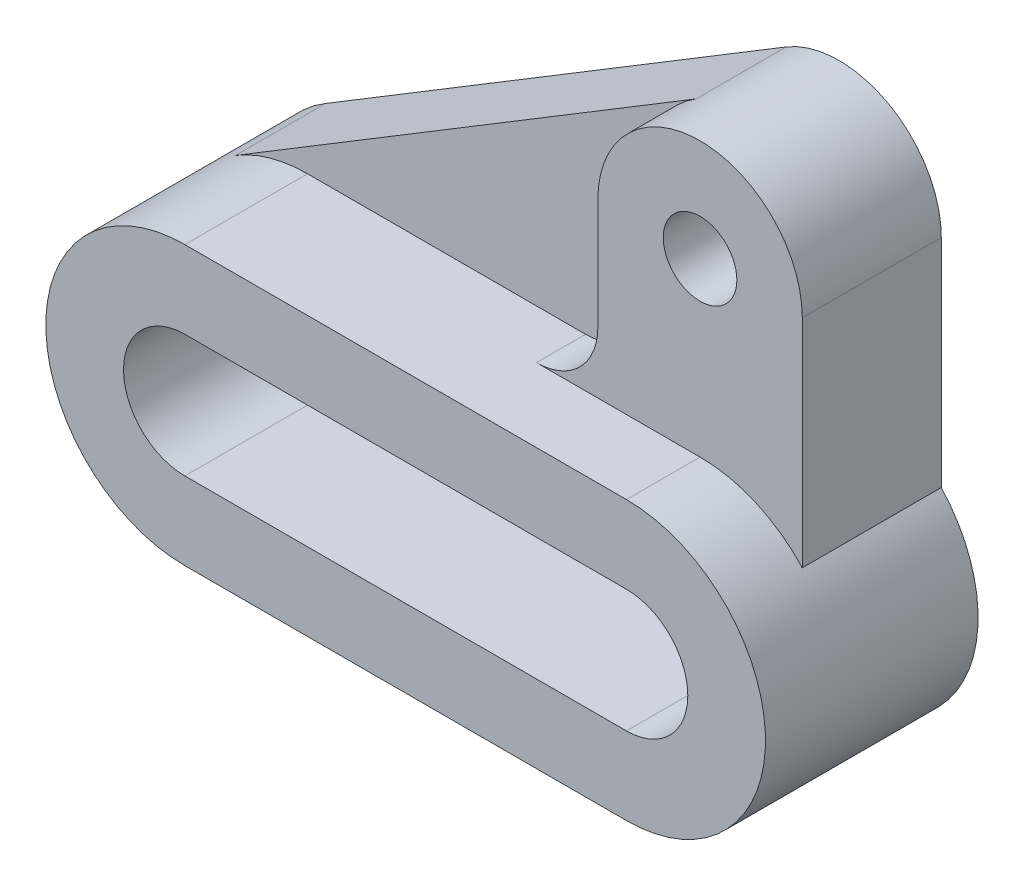
ISO-10303-21;
HEADER;
FILE_DESCRIPTION(('STEP AP214'),'2;1');
FILE_NAME('part.step','',(''),(''),'','','');
FILE_SCHEMA(('AUTOMOTIVE_DESIGN { 1 0 10303 214 1 1 1 1 }'));
ENDSEC;
DATA;
#1=APPLICATION_CONTEXT('core data for automotive mechanical design processes');
#2=APPLICATION_PROTOCOL_DEFINITION('international standard','automotive_design',2000,#1);
#3=PRODUCT_CONTEXT('',#1,'mechanical');
#4=PRODUCT('Part','Part','',(#3));
#5=PRODUCT_RELATED_PRODUCT_CATEGORY('part','',(#4));
#6=PRODUCT_DEFINITION_FORMATION('','',#4);
#7=PRODUCT_DEFINITION_CONTEXT('part definition',#1,'design');
#8=PRODUCT_DEFINITION('design','',#6,#7);
#9=PRODUCT_DEFINITION_SHAPE('','',#8);
#10=(LENGTH_UNIT() NAMED_UNIT(*) SI_UNIT(.MILLI.,.METRE.));
#11=(NAMED_UNIT(*) PLANE_ANGLE_UNIT() SI_UNIT($,.RADIAN.));
#12=(NAMED_UNIT(*) SI_UNIT($,.STERADIAN.) SOLID_ANGLE_UNIT());
#13=UNCERTAINTY_MEASURE_WITH_UNIT(LENGTH_MEASURE(1.E-05),#10,'distance_accuracy_value','');
#14=(GEOMETRIC_REPRESENTATION_CONTEXT(3) GLOBAL_UNCERTAINTY_ASSIGNED_CONTEXT((#13)) GLOBAL_UNIT_ASSIGNED_CONTEXT((#10,
#11,#12)) REPRESENTATION_CONTEXT('',''));
#15=CARTESIAN_POINT('',(0.,0.,0.));
#16=DIRECTION('',(0.,0.,1.));
#17=DIRECTION('',(1.,0.,0.));
#18=AXIS2_PLACEMENT_3D('',#15,#16,#17);
#19=CARTESIAN_POINT('',(0.,34.,52.));
#20=DIRECTION('',(0.,1.,0.));
#21=DIRECTION('',(-1.,0.,0.));
#22=AXIS2_PLACEMENT_3D('',#19,#20,#21);
#23=PLANE('',#22);
#24=DIRECTION('',(1.,0.,0.));
#25=VECTOR('',#24,1.);
#26=CARTESIAN_POINT('',(0.,34.,34.));
#27=LINE('',#26,#25);
#28=CARTESIAN_POINT('',(68.,34.,34.));
#29=VERTEX_POINT('',#28);
#30=CARTESIAN_POINT('',(108.,34.,34.));
#31=VERTEX_POINT('',#30);
#32=EDGE_CURVE('E181',#29,#31,#27,.T.);
#33=ORIENTED_EDGE('',*,*,#32,.F.);
#34=DIRECTION('',(0.,0.,-1.));
#35=VECTOR('',#34,1.);
#36=CARTESIAN_POINT('',(68.,34.,52.));
#37=LINE('',#36,#35);
#38=CARTESIAN_POINT('',(68.,34.,22.));
#39=VERTEX_POINT('',#38);
#40=EDGE_CURVE('E266',#29,#39,#37,.T.);
#41=ORIENTED_EDGE('',*,*,#40,.T.);
#42=DIRECTION('',(1.,0.,0.));
#43=VECTOR('',#42,1.);
#44=CARTESIAN_POINT('',(0.,34.,22.));
#45=LINE('',#44,#43);
#46=CARTESIAN_POINT('',(0.,34.,22.));
#47=VERTEX_POINT('',#46);
#48=EDGE_CURVE('E200',#47,#39,#45,.T.);
#49=ORIENTED_EDGE('',*,*,#48,.F.);
#50=DIRECTION('',(0.,0.,-1.));
#51=VECTOR('',#50,1.);
#52=CARTESIAN_POINT('',(0.,34.,52.));
#53=LINE('',#52,#51);
#54=CARTESIAN_POINT('',(0.,34.,52.));
#55=VERTEX_POINT('',#54);
#56=EDGE_CURVE('E263',#55,#47,#53,.T.);
#57=ORIENTED_EDGE('',*,*,#56,.F.);
#58=DIRECTION('',(1.,0.,0.));
#59=VECTOR('',#58,1.);
#60=CARTESIAN_POINT('',(0.,34.,52.));
#61=LINE('',#60,#59);
#62=CARTESIAN_POINT('',(108.,34.,52.));
#63=VERTEX_POINT('',#62);
#64=EDGE_CURVE('E224',#55,#63,#61,.T.);
#65=ORIENTED_EDGE('',*,*,#64,.T.);
#66=DIRECTION('',(0.,0.,-1.));
#67=VECTOR('',#66,1.);
#68=CARTESIAN_POINT('',(108.,34.,52.));
#69=LINE('',#68,#67);
#70=EDGE_CURVE('E253',#63,#31,#69,.T.);
#71=ORIENTED_EDGE('',*,*,#70,.T.);
#72=EDGE_LOOP('',(#33,#41,#49,#57,#65,#71));
#73=FACE_BOUND('',#72,.T.);
#74=ADVANCED_FACE('F41',(#73),#23,.T.);
#75=CARTESIAN_POINT('',(0.,0.,52.));
#76=DIRECTION('',(0.,0.,-1.));
#77=DIRECTION('',(-1.,0.,0.));
#78=AXIS2_PLACEMENT_3D('',#75,#76,#77);
#79=CYLINDRICAL_SURFACE('',#78,34.);
#80=CARTESIAN_POINT('',(0.,0.,22.));
#81=DIRECTION('',(0.,0.,1.));
#82=DIRECTION('',(1.,0.,0.));
#83=AXIS2_PLACEMENT_3D('',#80,#81,#82);
#84=CIRCLE('',#83,34.);
#85=CARTESIAN_POINT('',(-17.6263298981798,29.0742582763608,22.));
#86=VERTEX_POINT('',#85);
#87=EDGE_CURVE('E197',#47,#86,#84,.T.);
#88=ORIENTED_EDGE('',*,*,#87,.T.);
#89=DIRECTION('',(0.,0.,-1.));
#90=VECTOR('',#89,1.);
#91=CARTESIAN_POINT('',(-17.6263298981798,29.0742582763608,22.));
#92=LINE('',#91,#90);
#93=CARTESIAN_POINT('',(-17.6263298981798,29.0742582763608,0.));
#94=VERTEX_POINT('',#93);
#95=EDGE_CURVE('E204',#86,#94,#92,.T.);
#96=ORIENTED_EDGE('',*,*,#95,.T.);
#97=CARTESIAN_POINT('',(0.,0.,0.));
#98=DIRECTION('',(0.,0.,1.));
#99=DIRECTION('',(1.,0.,0.));
#100=AXIS2_PLACEMENT_3D('',#97,#98,#99);
#101=CIRCLE('',#100,34.);
#102=CARTESIAN_POINT('',(0.,-34.,0.));
#103=VERTEX_POINT('',#102);
#104=EDGE_CURVE('E247',#94,#103,#101,.T.);
#105=ORIENTED_EDGE('',*,*,#104,.T.);
#106=DIRECTION('',(0.,0.,-1.));
#107=VECTOR('',#106,1.);
#108=CARTESIAN_POINT('',(0.,-34.,52.));
#109=LINE('',#108,#107);
#110=CARTESIAN_POINT('',(0.,-34.,52.));
#111=VERTEX_POINT('',#110);
#112=EDGE_CURVE('E260',#111,#103,#109,.T.);
#113=ORIENTED_EDGE('',*,*,#112,.F.);
#114=CARTESIAN_POINT('',(0.,0.,52.));
#115=DIRECTION('',(0.,0.,1.));
#116=DIRECTION('',(1.,0.,0.));
#117=AXIS2_PLACEMENT_3D('',#114,#115,#116);
#118=CIRCLE('',#117,34.);
#119=EDGE_CURVE('E227',#55,#111,#118,.T.);
#120=ORIENTED_EDGE('',*,*,#119,.F.);
#121=ORIENTED_EDGE('',*,*,#56,.T.);
#122=EDGE_LOOP('',(#88,#96,#105,#113,#120,#121));
#123=FACE_BOUND('',#122,.T.);
#124=ADVANCED_FACE('F283',(#123),#79,.T.);
#125=CARTESIAN_POINT('',(0.,-34.,52.));
#126=DIRECTION('',(0.,1.,0.));
#127=DIRECTION('',(-1.,0.,0.));
#128=AXIS2_PLACEMENT_3D('',#125,#126,#127);
#129=PLANE('',#128);
#130=DIRECTION('',(1.,0.,0.));
#131=VECTOR('',#130,1.);
#132=CARTESIAN_POINT('',(0.,-34.,0.));
#133=LINE('',#132,#131);
#134=CARTESIAN_POINT('',(108.,-34.,0.));
#135=VERTEX_POINT('',#134);
#136=EDGE_CURVE('E249',#103,#135,#133,.T.);
#137=ORIENTED_EDGE('',*,*,#136,.T.);
#138=DIRECTION('',(0.,0.,-1.));
#139=VECTOR('',#138,1.);
#140=CARTESIAN_POINT('',(108.,-34.,52.));
#141=LINE('',#140,#139);
#142=CARTESIAN_POINT('',(108.,-34.,52.));
#143=VERTEX_POINT('',#142);
#144=EDGE_CURVE('E256',#143,#135,#141,.T.);
#145=ORIENTED_EDGE('',*,*,#144,.F.);
#146=DIRECTION('',(1.,0.,0.));
#147=VECTOR('',#146,1.);
#148=CARTESIAN_POINT('',(0.,-34.,52.));
#149=LINE('',#148,#147);
#150=EDGE_CURVE('E230',#111,#143,#149,.T.);
#151=ORIENTED_EDGE('',*,*,#150,.F.);
#152=ORIENTED_EDGE('',*,*,#112,.T.);
#153=EDGE_LOOP('',(#137,#145,#151,#152));
#154=FACE_BOUND('',#153,.T.);
#155=ADVANCED_FACE('F317',(#154),#129,.F.);
#156=CARTESIAN_POINT('',(108.,0.,52.));
#157=DIRECTION('',(0.,0.,-1.));
#158=DIRECTION('',(-1.,0.,0.));
#159=AXIS2_PLACEMENT_3D('',#156,#157,#158);
#160=CYLINDRICAL_SURFACE('',#159,15.);
#161=CARTESIAN_POINT('',(108.,0.,0.));
#162=DIRECTION('',(0.,0.,1.));
#163=DIRECTION('',(1.,0.,0.));
#164=AXIS2_PLACEMENT_3D('',#161,#162,#163);
#165=CIRCLE('',#164,15.);
#166=CARTESIAN_POINT('',(108.,-15.,0.));
#167=VERTEX_POINT('',#166);
#168=CARTESIAN_POINT('',(108.,15.,0.));
#169=VERTEX_POINT('',#168);
#170=EDGE_CURVE('E211',#167,#169,#165,.T.);
#171=ORIENTED_EDGE('',*,*,#170,.F.);
#172=DIRECTION('',(0.,0.,-1.));
#173=VECTOR('',#172,1.);
#174=CARTESIAN_POINT('',(108.,-15.,52.));
#175=LINE('',#174,#173);
#176=CARTESIAN_POINT('',(108.,-15.,52.));
#177=VERTEX_POINT('',#176);
#178=EDGE_CURVE('E257',#177,#167,#175,.T.);
#179=ORIENTED_EDGE('',*,*,#178,.F.);
#180=CARTESIAN_POINT('',(108.,0.,52.));
#181=DIRECTION('',(0.,0.,1.));
#182=DIRECTION('',(1.,0.,0.));
#183=AXIS2_PLACEMENT_3D('',#180,#181,#182);
#184=CIRCLE('',#183,15.);
#185=CARTESIAN_POINT('',(108.,15.,52.));
#186=VERTEX_POINT('',#185);
#187=EDGE_CURVE('E212',#177,#186,#184,.T.);
#188=ORIENTED_EDGE('',*,*,#187,.T.);
#189=DIRECTION('',(0.,0.,-1.));
#190=VECTOR('',#189,1.);
#191=CARTESIAN_POINT('',(108.,15.,52.));
#192=LINE('',#191,#190);
#193=EDGE_CURVE('E235',#186,#169,#192,.T.);
#194=ORIENTED_EDGE('',*,*,#193,.T.);
#195=EDGE_LOOP('',(#171,#179,#188,#194));
#196=FACE_BOUND('',#195,.T.);
#197=ADVANCED_FACE('F331',(#196),#160,.F.);
#198=CARTESIAN_POINT('',(0.,-15.,52.));
#199=DIRECTION('',(0.,1.,0.));
#200=DIRECTION('',(-1.,0.,0.));
#201=AXIS2_PLACEMENT_3D('',#198,#199,#200);
#202=PLANE('',#201);
#203=DIRECTION('',(1.,0.,0.));
#204=VECTOR('',#203,1.);
#205=CARTESIAN_POINT('',(0.,-15.,0.));
#206=LINE('',#205,#204);
#207=CARTESIAN_POINT('',(0.,-15.,0.));
#208=VERTEX_POINT('',#207);
#209=EDGE_CURVE('E238',#208,#167,#206,.T.);
#210=ORIENTED_EDGE('',*,*,#209,.F.);
#211=DIRECTION('',(0.,0.,-1.));
#212=VECTOR('',#211,1.);
#213=CARTESIAN_POINT('',(0.,-15.,52.));
#214=LINE('',#213,#212);
#215=CARTESIAN_POINT('',(0.,-15.,52.));
#216=VERTEX_POINT('',#215);
#217=EDGE_CURVE('E270',#216,#208,#214,.T.);
#218=ORIENTED_EDGE('',*,*,#217,.F.);
#219=DIRECTION('',(1.,0.,0.));
#220=VECTOR('',#219,1.);
#221=CARTESIAN_POINT('',(0.,-15.,52.));
#222=LINE('',#221,#220);
#223=EDGE_CURVE('E215',#216,#177,#222,.T.);
#224=ORIENTED_EDGE('',*,*,#223,.T.);
#225=ORIENTED_EDGE('',*,*,#178,.T.);
#226=EDGE_LOOP('',(#210,#218,#224,#225));
#227=FACE_BOUND('',#226,.T.);
#228=ADVANCED_FACE('F328',(#227),#202,.T.);
#229=CARTESIAN_POINT('',(0.,0.,52.));
#230=DIRECTION('',(0.,0.,-1.));
#231=DIRECTION('',(-1.,0.,0.));
#232=AXIS2_PLACEMENT_3D('',#229,#230,#231);
#233=CYLINDRICAL_SURFACE('',#232,15.);
#234=CARTESIAN_POINT('',(0.,0.,0.));
#235=DIRECTION('',(0.,0.,1.));
#236=DIRECTION('',(1.,0.,0.));
#237=AXIS2_PLACEMENT_3D('',#234,#235,#236);
#238=CIRCLE('',#237,15.);
#239=CARTESIAN_POINT('',(0.,15.,0.));
#240=VERTEX_POINT('',#239);
#241=EDGE_CURVE('E241',#240,#208,#238,.T.);
#242=ORIENTED_EDGE('',*,*,#241,.F.);
#243=DIRECTION('',(0.,0.,-1.));
#244=VECTOR('',#243,1.);
#245=CARTESIAN_POINT('',(0.,15.,52.));
#246=LINE('',#245,#244);
#247=CARTESIAN_POINT('',(0.,15.,52.));
#248=VERTEX_POINT('',#247);
#249=EDGE_CURVE('E268',#248,#240,#246,.T.);
#250=ORIENTED_EDGE('',*,*,#249,.F.);
#251=CARTESIAN_POINT('',(0.,0.,52.));
#252=DIRECTION('',(0.,0.,1.));
#253=DIRECTION('',(1.,0.,0.));
#254=AXIS2_PLACEMENT_3D('',#251,#252,#253);
#255=CIRCLE('',#254,15.);
#256=EDGE_CURVE('E219',#248,#216,#255,.T.);
#257=ORIENTED_EDGE('',*,*,#256,.T.);
#258=ORIENTED_EDGE('',*,*,#217,.T.);
#259=EDGE_LOOP('',(#242,#250,#257,#258));
#260=FACE_BOUND('',#259,.T.);
#261=ADVANCED_FACE('F324',(#260),#233,.F.);
#262=CARTESIAN_POINT('',(0.,15.,52.));
#263=DIRECTION('',(0.,1.,0.));
#264=DIRECTION('',(-1.,0.,0.));
#265=AXIS2_PLACEMENT_3D('',#262,#263,#264);
#266=PLANE('',#265);
#267=DIRECTION('',(1.,0.,0.));
#268=VECTOR('',#267,1.);
#269=CARTESIAN_POINT('',(0.,15.,0.));
#270=LINE('',#269,#268);
#271=EDGE_CURVE('E244',#240,#169,#270,.T.);
#272=ORIENTED_EDGE('',*,*,#271,.T.);
#273=ORIENTED_EDGE('',*,*,#193,.F.);
#274=DIRECTION('',(1.,0.,0.));
#275=VECTOR('',#274,1.);
#276=CARTESIAN_POINT('',(0.,15.,52.));
#277=LINE('',#276,#275);
#278=EDGE_CURVE('E222',#248,#186,#277,.T.);
#279=ORIENTED_EDGE('',*,*,#278,.F.);
#280=ORIENTED_EDGE('',*,*,#249,.T.);
#281=EDGE_LOOP('',(#272,#273,#279,#280));
#282=FACE_BOUND('',#281,.T.);
#283=ADVANCED_FACE('F321',(#282),#266,.F.);
#284=CARTESIAN_POINT('',(108.,0.,52.));
#285=DIRECTION('',(0.,0.,-1.));
#286=DIRECTION('',(-1.,0.,0.));
#287=AXIS2_PLACEMENT_3D('',#284,#285,#286);
#288=CYLINDRICAL_SURFACE('',#287,34.);
#289=CARTESIAN_POINT('',(108.,0.,0.));
#290=DIRECTION('',(0.,0.,1.));
#291=DIRECTION('',(1.,0.,0.));
#292=AXIS2_PLACEMENT_3D('',#289,#290,#291);
#293=CIRCLE('',#292,34.);
#294=CARTESIAN_POINT('',(133.,23.0434372436058,0.));
#295=VERTEX_POINT('',#294);
#296=EDGE_CURVE('E216',#135,#295,#293,.T.);
#297=ORIENTED_EDGE('',*,*,#296,.T.);
#298=DIRECTION('',(0.,0.,-1.));
#299=VECTOR('',#298,1.);
#300=CARTESIAN_POINT('',(133.,23.0434372436058,34.));
#301=LINE('',#300,#299);
#302=CARTESIAN_POINT('',(133.,23.0434372436058,34.));
#303=VERTEX_POINT('',#302);
#304=EDGE_CURVE('E184',#303,#295,#301,.T.);
#305=ORIENTED_EDGE('',*,*,#304,.F.);
#306=CARTESIAN_POINT('',(108.,0.,34.));
#307=DIRECTION('',(0.,0.,1.));
#308=DIRECTION('',(1.,0.,0.));
#309=AXIS2_PLACEMENT_3D('',#306,#307,#308);
#310=CIRCLE('',#309,34.);
#311=EDGE_CURVE('E173',#303,#31,#310,.T.);
#312=ORIENTED_EDGE('',*,*,#311,.T.);
#313=ORIENTED_EDGE('',*,*,#70,.F.);
#314=CARTESIAN_POINT('',(108.,0.,52.));
#315=DIRECTION('',(0.,0.,1.));
#316=DIRECTION('',(1.,0.,0.));
#317=AXIS2_PLACEMENT_3D('',#314,#315,#316);
#318=CIRCLE('',#317,34.);
#319=EDGE_CURVE('E233',#143,#63,#318,.T.);
#320=ORIENTED_EDGE('',*,*,#319,.F.);
#321=ORIENTED_EDGE('',*,*,#144,.T.);
#322=EDGE_LOOP('',(#297,#305,#312,#313,#320,#321));
#323=FACE_BOUND('',#322,.T.);
#324=ADVANCED_FACE('F293',(#323),#288,.T.);
#325=CARTESIAN_POINT('',(0.,0.,52.));
#326=DIRECTION('',(0.,0.,1.));
#327=DIRECTION('',(1.,0.,0.));
#328=AXIS2_PLACEMENT_3D('',#325,#326,#327);
#329=PLANE('',#328);
#330=ORIENTED_EDGE('',*,*,#187,.F.);
#331=ORIENTED_EDGE('',*,*,#223,.F.);
#332=ORIENTED_EDGE('',*,*,#256,.F.);
#333=ORIENTED_EDGE('',*,*,#278,.T.);
#334=EDGE_LOOP('',(#330,#331,#332,#333));
#335=FACE_BOUND('',#334,.T.);
#336=ORIENTED_EDGE('',*,*,#64,.F.);
#337=ORIENTED_EDGE('',*,*,#119,.T.);
#338=ORIENTED_EDGE('',*,*,#150,.T.);
#339=ORIENTED_EDGE('',*,*,#319,.T.);
#340=EDGE_LOOP('',(#336,#337,#338,#339));
#341=FACE_BOUND('',#340,.T.);
#342=ADVANCED_FACE('F290',(#335,#341),#329,.T.);
#343=CARTESIAN_POINT('',(0.,0.,0.));
#344=DIRECTION('',(0.,0.,1.));
#345=DIRECTION('',(1.,0.,0.));
#346=AXIS2_PLACEMENT_3D('',#343,#344,#345);
#347=PLANE('',#346);
#348=ORIENTED_EDGE('',*,*,#104,.F.);
#349=DIRECTION('',(0.855125243422376,0.518421467593524,0.));
#350=VECTOR('',#349,1.);
#351=CARTESIAN_POINT('',(-17.6263298981798,29.0742582763608,0.));
#352=LINE('',#351,#350);
#353=CARTESIAN_POINT('',(95.0394633101619,97.3781310855594,0.));
#354=VERTEX_POINT('',#353);
#355=EDGE_CURVE('E159',#94,#354,#352,.T.);
#356=ORIENTED_EDGE('',*,*,#355,.T.);
#357=CARTESIAN_POINT('',(108.,76.,0.));
#358=DIRECTION('',(0.,0.,1.));
#359=DIRECTION('',(1.,0.,0.));
#360=AXIS2_PLACEMENT_3D('',#357,#358,#359);
#361=CIRCLE('',#360,25.);
#362=CARTESIAN_POINT('',(133.,76.,0.));
#363=VERTEX_POINT('',#362);
#364=EDGE_CURVE('E177',#363,#354,#361,.T.);
#365=ORIENTED_EDGE('',*,*,#364,.F.);
#366=DIRECTION('',(0.,-1.,0.));
#367=VECTOR('',#366,1.);
#368=CARTESIAN_POINT('',(133.,0.,0.));
#369=LINE('',#368,#367);
#370=EDGE_CURVE('E155',#363,#295,#369,.T.);
#371=ORIENTED_EDGE('',*,*,#370,.T.);
#372=ORIENTED_EDGE('',*,*,#296,.F.);
#373=ORIENTED_EDGE('',*,*,#136,.F.);
#374=EDGE_LOOP('',(#348,#356,#365,#371,#372,#373));
#375=FACE_BOUND('',#374,.T.);
#376=ORIENTED_EDGE('',*,*,#170,.T.);
#377=ORIENTED_EDGE('',*,*,#271,.F.);
#378=ORIENTED_EDGE('',*,*,#241,.T.);
#379=ORIENTED_EDGE('',*,*,#209,.T.);
#380=EDGE_LOOP('',(#376,#377,#378,#379));
#381=FACE_BOUND('',#380,.T.);
#382=CARTESIAN_POINT('',(108.,76.,0.));
#383=DIRECTION('',(0.,0.,1.));
#384=DIRECTION('',(1.,0.,0.));
#385=AXIS2_PLACEMENT_3D('',#382,#383,#384);
#386=CIRCLE('',#385,8.99999999999999);
#387=CARTESIAN_POINT('',(117.,76.,0.));
#388=VERTEX_POINT('',#387);
#389=EDGE_CURVE('E185',#388,#388,#386,.T.);
#390=ORIENTED_EDGE('',*,*,#389,.T.);
#391=EDGE_LOOP('',(#390));
#392=FACE_BOUND('',#391,.T.);
#393=ADVANCED_FACE('F295',(#375,#381,#392),#347,.F.);
#394=CARTESIAN_POINT('',(-17.6263298981798,29.0742582763608,22.));
#395=DIRECTION('',(-0.518421467593523,0.855125243422376,0.));
#396=DIRECTION('',(-0.855125243422376,-0.518421467593523,0.));
#397=AXIS2_PLACEMENT_3D('',#394,#395,#396);
#398=PLANE('',#397);
#399=ORIENTED_EDGE('',*,*,#355,.F.);
#400=ORIENTED_EDGE('',*,*,#95,.F.);
#401=DIRECTION('',(0.855125243422376,0.518421467593524,0.));
#402=VECTOR('',#401,1.);
#403=CARTESIAN_POINT('',(-17.6263298981798,29.0742582763608,22.));
#404=LINE('',#403,#402);
#405=CARTESIAN_POINT('',(95.0394633101619,97.3781310855594,22.));
#406=VERTEX_POINT('',#405);
#407=EDGE_CURVE('E194',#86,#406,#404,.T.);
#408=ORIENTED_EDGE('',*,*,#407,.T.);
#409=DIRECTION('',(0.,0.,-1.));
#410=VECTOR('',#409,1.);
#411=CARTESIAN_POINT('',(95.0394633101619,97.3781310855594,22.));
#412=LINE('',#411,#410);
#413=EDGE_CURVE('E209',#406,#354,#412,.T.);
#414=ORIENTED_EDGE('',*,*,#413,.T.);
#415=EDGE_LOOP('',(#399,#400,#408,#414));
#416=FACE_BOUND('',#415,.T.);
#417=ADVANCED_FACE('F300',(#416),#398,.T.);
#418=CARTESIAN_POINT('',(0.,0.,22.));
#419=DIRECTION('',(0.,0.,1.));
#420=DIRECTION('',(1.,0.,0.));
#421=AXIS2_PLACEMENT_3D('',#418,#419,#420);
#422=PLANE('',#421);
#423=ORIENTED_EDGE('',*,*,#48,.T.);
#424=CARTESIAN_POINT('',(68.,49.,22.));
#425=DIRECTION('',(0.,0.,1.));
#426=DIRECTION('',(1.,0.,0.));
#427=AXIS2_PLACEMENT_3D('',#424,#425,#426);
#428=CIRCLE('',#427,15.);
#429=CARTESIAN_POINT('',(83.,49.,22.));
#430=VERTEX_POINT('',#429);
#431=EDGE_CURVE('E63',#39,#430,#428,.T.);
#432=ORIENTED_EDGE('',*,*,#431,.T.);
#433=DIRECTION('',(0.,-1.,0.));
#434=VECTOR('',#433,1.);
#435=CARTESIAN_POINT('',(83.,0.,22.));
#436=LINE('',#435,#434);
#437=CARTESIAN_POINT('',(83.,76.,22.));
#438=VERTEX_POINT('',#437);
#439=EDGE_CURVE('E202',#438,#430,#436,.T.);
#440=ORIENTED_EDGE('',*,*,#439,.F.);
#441=CARTESIAN_POINT('',(108.,76.,22.));
#442=DIRECTION('',(0.,0.,1.));
#443=DIRECTION('',(1.,0.,0.));
#444=AXIS2_PLACEMENT_3D('',#441,#442,#443);
#445=CIRCLE('',#444,25.);
#446=EDGE_CURVE('E192',#406,#438,#445,.T.);
#447=ORIENTED_EDGE('',*,*,#446,.F.);
#448=ORIENTED_EDGE('',*,*,#407,.F.);
#449=ORIENTED_EDGE('',*,*,#87,.F.);
#450=EDGE_LOOP('',(#423,#432,#440,#447,#448,#449));
#451=FACE_BOUND('',#450,.T.);
#452=ADVANCED_FACE('F280',(#451),#422,.T.);
#453=CARTESIAN_POINT('',(108.,76.,34.));
#454=DIRECTION('',(0.,0.,-1.));
#455=DIRECTION('',(-1.,0.,0.));
#456=AXIS2_PLACEMENT_3D('',#453,#454,#455);
#457=CYLINDRICAL_SURFACE('',#456,25.);
#458=ORIENTED_EDGE('',*,*,#364,.T.);
#459=ORIENTED_EDGE('',*,*,#413,.F.);
#460=ORIENTED_EDGE('',*,*,#446,.T.);
#461=DIRECTION('',(0.,0.,-1.));
#462=VECTOR('',#461,1.);
#463=CARTESIAN_POINT('',(83.,76.,34.));
#464=LINE('',#463,#462);
#465=CARTESIAN_POINT('',(83.,76.,34.));
#466=VERTEX_POINT('',#465);
#467=EDGE_CURVE('E160',#466,#438,#464,.T.);
#468=ORIENTED_EDGE('',*,*,#467,.F.);
#469=CARTESIAN_POINT('',(108.,76.,34.));
#470=DIRECTION('',(0.,0.,1.));
#471=DIRECTION('',(1.,0.,0.));
#472=AXIS2_PLACEMENT_3D('',#469,#470,#471);
#473=CIRCLE('',#472,25.);
#474=CARTESIAN_POINT('',(133.,76.,34.));
#475=VERTEX_POINT('',#474);
#476=EDGE_CURVE('E164',#475,#466,#473,.T.);
#477=ORIENTED_EDGE('',*,*,#476,.F.);
#478=DIRECTION('',(0.,0.,-1.));
#479=VECTOR('',#478,1.);
#480=CARTESIAN_POINT('',(133.,76.,34.));
#481=LINE('',#480,#479);
#482=EDGE_CURVE('E147',#475,#363,#481,.T.);
#483=ORIENTED_EDGE('',*,*,#482,.T.);
#484=EDGE_LOOP('',(#458,#459,#460,#468,#477,#483));
#485=FACE_BOUND('',#484,.T.);
#486=ADVANCED_FACE('F165',(#485),#457,.T.);
#487=CARTESIAN_POINT('',(133.,0.,34.));
#488=DIRECTION('',(1.,0.,0.));
#489=DIRECTION('',(0.,0.,-1.));
#490=AXIS2_PLACEMENT_3D('',#487,#488,#489);
#491=PLANE('',#490);
#492=ORIENTED_EDGE('',*,*,#370,.F.);
#493=ORIENTED_EDGE('',*,*,#482,.F.);
#494=DIRECTION('',(0.,-1.,0.));
#495=VECTOR('',#494,1.);
#496=CARTESIAN_POINT('',(133.,0.,34.));
#497=LINE('',#496,#495);
#498=EDGE_CURVE('E152',#475,#303,#497,.T.);
#499=ORIENTED_EDGE('',*,*,#498,.T.);
#500=ORIENTED_EDGE('',*,*,#304,.T.);
#501=EDGE_LOOP('',(#492,#493,#499,#500));
#502=FACE_BOUND('',#501,.T.);
#503=ADVANCED_FACE('F149',(#502),#491,.T.);
#504=CARTESIAN_POINT('',(83.,0.,34.));
#505=DIRECTION('',(1.,0.,0.));
#506=DIRECTION('',(0.,0.,-1.));
#507=AXIS2_PLACEMENT_3D('',#504,#505,#506);
#508=PLANE('',#507);
#509=ORIENTED_EDGE('',*,*,#439,.T.);
#510=DIRECTION('',(0.,0.,-1.));
#511=VECTOR('',#510,1.);
#512=CARTESIAN_POINT('',(83.,49.,34.));
#513=LINE('',#512,#511);
#514=CARTESIAN_POINT('',(83.,49.,34.));
#515=VERTEX_POINT('',#514);
#516=EDGE_CURVE('E49',#430,#515,#513,.F.);
#517=ORIENTED_EDGE('',*,*,#516,.T.);
#518=DIRECTION('',(0.,-1.,0.));
#519=VECTOR('',#518,1.);
#520=CARTESIAN_POINT('',(83.,0.,34.));
#521=LINE('',#520,#519);
#522=EDGE_CURVE('E169',#466,#515,#521,.T.);
#523=ORIENTED_EDGE('',*,*,#522,.F.);
#524=ORIENTED_EDGE('',*,*,#467,.T.);
#525=EDGE_LOOP('',(#509,#517,#523,#524));
#526=FACE_BOUND('',#525,.T.);
#527=ADVANCED_FACE('F388',(#526),#508,.F.);
#528=CARTESIAN_POINT('',(108.,76.,34.));
#529=DIRECTION('',(0.,0.,-1.));
#530=DIRECTION('',(-1.,0.,0.));
#531=AXIS2_PLACEMENT_3D('',#528,#529,#530);
#532=CYLINDRICAL_SURFACE('',#531,8.99999999999999);
#533=CARTESIAN_POINT('',(108.,76.,34.));
#534=DIRECTION('',(0.,0.,1.));
#535=DIRECTION('',(1.,0.,0.));
#536=AXIS2_PLACEMENT_3D('',#533,#534,#535);
#537=CIRCLE('',#536,8.99999999999999);
#538=CARTESIAN_POINT('',(117.,76.,34.));
#539=VERTEX_POINT('',#538);
#540=EDGE_CURVE('E174',#539,#539,#537,.T.);
#541=ORIENTED_EDGE('',*,*,#540,.T.);
#542=EDGE_LOOP('',(#541));
#543=FACE_BOUND('',#542,.T.);
#544=ORIENTED_EDGE('',*,*,#389,.F.);
#545=EDGE_LOOP('',(#544));
#546=FACE_BOUND('',#545,.T.);
#547=ADVANCED_FACE('F397',(#543,#546),#532,.F.);
#548=CARTESIAN_POINT('',(0.,0.,34.));
#549=DIRECTION('',(0.,0.,1.));
#550=DIRECTION('',(1.,0.,0.));
#551=AXIS2_PLACEMENT_3D('',#548,#549,#550);
#552=PLANE('',#551);
#553=ORIENTED_EDGE('',*,*,#540,.F.);
#554=EDGE_LOOP('',(#553));
#555=FACE_BOUND('',#554,.T.);
#556=ORIENTED_EDGE('',*,*,#498,.F.);
#557=ORIENTED_EDGE('',*,*,#476,.T.);
#558=ORIENTED_EDGE('',*,*,#522,.T.);
#559=CARTESIAN_POINT('',(68.,49.,34.));
#560=DIRECTION('',(0.,0.,1.));
#561=DIRECTION('',(1.,0.,0.));
#562=AXIS2_PLACEMENT_3D('',#559,#560,#561);
#563=CIRCLE('',#562,15.);
#564=EDGE_CURVE('E11',#515,#29,#563,.F.);
#565=ORIENTED_EDGE('',*,*,#564,.T.);
#566=ORIENTED_EDGE('',*,*,#32,.T.);
#567=ORIENTED_EDGE('',*,*,#311,.F.);
#568=EDGE_LOOP('',(#556,#557,#558,#565,#566,#567));
#569=FACE_BOUND('',#568,.T.);
#570=ADVANCED_FACE('F171',(#555,#569),#552,.T.);
#571=CARTESIAN_POINT('',(68.,49.,52.));
#572=DIRECTION('',(0.,0.,-1.));
#573=DIRECTION('',(-1.,0.,0.));
#574=AXIS2_PLACEMENT_3D('',#571,#572,#573);
#575=CYLINDRICAL_SURFACE('',#574,15.);
#576=ORIENTED_EDGE('',*,*,#564,.F.);
#577=ORIENTED_EDGE('',*,*,#516,.F.);
#578=ORIENTED_EDGE('',*,*,#431,.F.);
#579=ORIENTED_EDGE('',*,*,#40,.F.);
#580=EDGE_LOOP('',(#576,#577,#578,#579));
#581=FACE_BOUND('',#580,.T.);
#582=ADVANCED_FACE('F43',(#581),#575,.F.);
#583=CLOSED_SHELL('',(#74,#124,#155,#197,#228,#261,#283,#324,#342,#393,#417,#452,#486,#503,#527,
#547,#570,#582));
#584=MANIFOLD_SOLID_BREP('B2',#583);
#585=ADVANCED_BREP_SHAPE_REPRESENTATION('',(#18,#584),#14);
#586=SHAPE_DEFINITION_REPRESENTATION(#9,#585);
ENDSEC;
END-ISO-10303-21;
